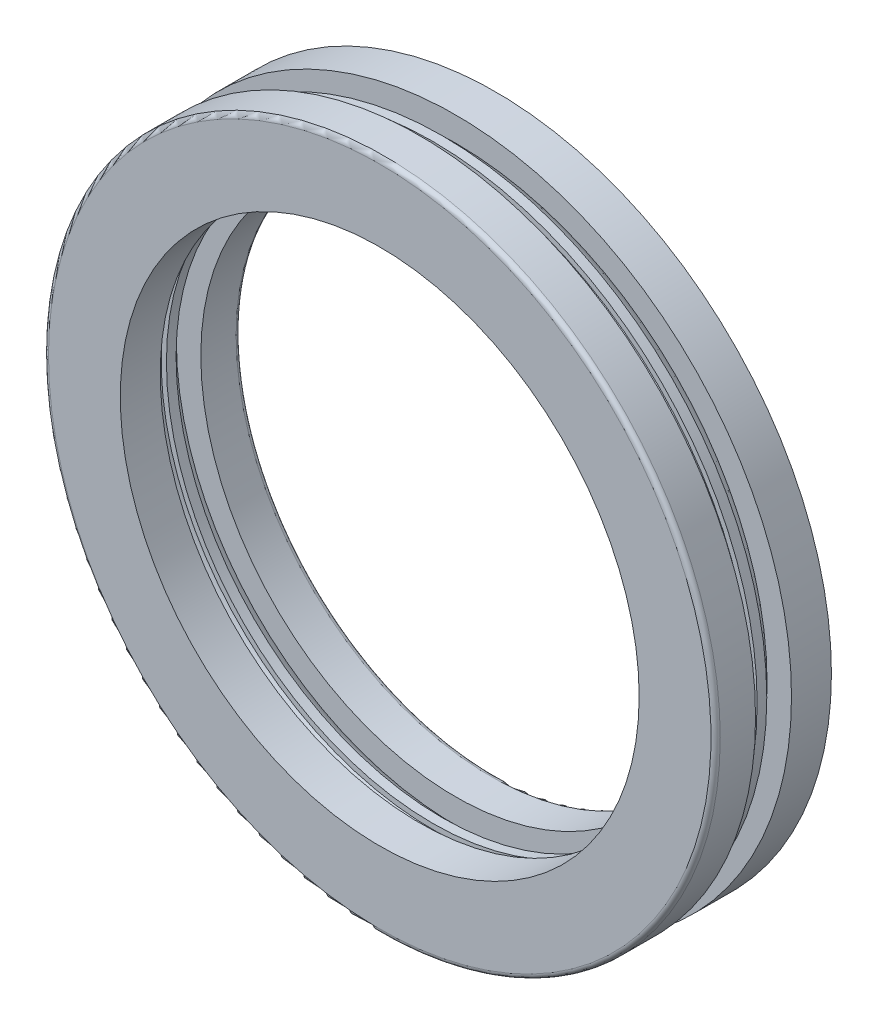
ISO-10303-21;
HEADER;
FILE_DESCRIPTION(('STEP AP214'),'2;1');
FILE_NAME('part.step','',(''),(''),'','','');
FILE_SCHEMA(('AUTOMOTIVE_DESIGN { 1 0 10303 214 1 1 1 1 }'));
ENDSEC;
DATA;
#1=APPLICATION_CONTEXT('core data for automotive mechanical design processes');
#2=APPLICATION_PROTOCOL_DEFINITION('international standard','automotive_design',2000,#1);
#3=PRODUCT_CONTEXT('',#1,'mechanical');
#4=PRODUCT('Part','Part','',(#3));
#5=PRODUCT_RELATED_PRODUCT_CATEGORY('part','',(#4));
#6=PRODUCT_DEFINITION_FORMATION('','',#4);
#7=PRODUCT_DEFINITION_CONTEXT('part definition',#1,'design');
#8=PRODUCT_DEFINITION('design','',#6,#7);
#9=PRODUCT_DEFINITION_SHAPE('','',#8);
#10=(LENGTH_UNIT() NAMED_UNIT(*) SI_UNIT(.MILLI.,.METRE.));
#11=(NAMED_UNIT(*) PLANE_ANGLE_UNIT() SI_UNIT($,.RADIAN.));
#12=(NAMED_UNIT(*) SI_UNIT($,.STERADIAN.) SOLID_ANGLE_UNIT());
#13=UNCERTAINTY_MEASURE_WITH_UNIT(LENGTH_MEASURE(1.E-05),#10,'distance_accuracy_value','');
#14=(GEOMETRIC_REPRESENTATION_CONTEXT(3) GLOBAL_UNCERTAINTY_ASSIGNED_CONTEXT((#13)) GLOBAL_UNIT_ASSIGNED_CONTEXT((#10,
#11,#12)) REPRESENTATION_CONTEXT('',''));
#15=CARTESIAN_POINT('',(0.,0.,0.));
#16=DIRECTION('',(0.,0.,1.));
#17=DIRECTION('',(1.,0.,0.));
#18=AXIS2_PLACEMENT_3D('',#15,#16,#17);
#19=CARTESIAN_POINT('',(0.,72.5,-3.87931034482759));
#20=DIRECTION('',(0.,0.,-1.));
#21=DIRECTION('',(-1.,0.,0.));
#22=AXIS2_PLACEMENT_3D('',#19,#20,#21);
#23=PLANE('',#22);
#24=CARTESIAN_POINT('',(0.,0.,-3.87931034482759));
#25=DIRECTION('',(0.,0.,1.));
#26=DIRECTION('',(1.,0.,0.));
#27=AXIS2_PLACEMENT_3D('',#24,#25,#26);
#28=CIRCLE('',#27,72.5);
#29=CARTESIAN_POINT('',(72.5,0.,-3.87931034482759));
#30=VERTEX_POINT('',#29);
#31=EDGE_CURVE('E83',#30,#30,#28,.T.);
#32=ORIENTED_EDGE('',*,*,#31,.T.);
#33=EDGE_LOOP('',(#32));
#34=FACE_BOUND('',#33,.T.);
#35=CARTESIAN_POINT('',(0.,0.,-3.87931034482759));
#36=DIRECTION('',(0.,0.,-1.));
#37=DIRECTION('',(-1.,0.,0.));
#38=AXIS2_PLACEMENT_3D('',#35,#36,#37);
#39=CIRCLE('',#38,67.2252967297232);
#40=CARTESIAN_POINT('',(-67.2252967297232,0.,-3.87931034482759));
#41=VERTEX_POINT('',#40);
#42=EDGE_CURVE('E10',#41,#41,#39,.F.);
#43=ORIENTED_EDGE('',*,*,#42,.F.);
#44=EDGE_LOOP('',(#43));
#45=FACE_BOUND('',#44,.T.);
#46=ADVANCED_FACE('F35',(#34,#45),#23,.F.);
#47=CARTESIAN_POINT('',(0.,60.2897080046681,-3.87931034482759));
#48=DIRECTION('',(0.,0.,-1.));
#49=DIRECTION('',(-1.,0.,0.));
#50=AXIS2_PLACEMENT_3D('',#47,#48,#49);
#51=PLANE('',#50);
#52=CARTESIAN_POINT('',(0.,0.,-3.87931034482759));
#53=DIRECTION('',(0.,0.,1.));
#54=DIRECTION('',(1.,0.,0.));
#55=AXIS2_PLACEMENT_3D('',#52,#53,#54);
#56=CIRCLE('',#55,55.);
#57=CARTESIAN_POINT('',(55.,0.,-3.87931034482759));
#58=VERTEX_POINT('',#57);
#59=EDGE_CURVE('E90',#58,#58,#56,.T.);
#60=ORIENTED_EDGE('',*,*,#59,.F.);
#61=EDGE_LOOP('',(#60));
#62=FACE_BOUND('',#61,.T.);
#63=CARTESIAN_POINT('',(0.,0.,-3.87931034482759));
#64=DIRECTION('',(0.,0.,1.));
#65=DIRECTION('',(1.,0.,0.));
#66=AXIS2_PLACEMENT_3D('',#63,#64,#65);
#67=CIRCLE('',#66,60.2747032702768);
#68=CARTESIAN_POINT('',(60.2747032702768,0.,-3.87931034482759));
#69=VERTEX_POINT('',#68);
#70=EDGE_CURVE('E44',#69,#69,#67,.F.);
#71=ORIENTED_EDGE('',*,*,#70,.F.);
#72=EDGE_LOOP('',(#71));
#73=FACE_BOUND('',#72,.T.);
#74=ADVANCED_FACE('F163',(#62,#73),#51,.F.);
#75=CARTESIAN_POINT('',(0.,0.,18.9590379297716));
#76=DIRECTION('',(0.,0.,1.));
#77=DIRECTION('',(1.,0.,0.));
#78=AXIS2_PLACEMENT_3D('',#75,#76,#77);
#79=CYLINDRICAL_SURFACE('',#78,55.);
#80=CARTESIAN_POINT('',(0.,0.,-11.5));
#81=DIRECTION('',(0.,0.,1.));
#82=DIRECTION('',(1.,0.,0.));
#83=AXIS2_PLACEMENT_3D('',#80,#81,#82);
#84=CIRCLE('',#83,55.);
#85=CARTESIAN_POINT('',(55.,0.,-11.5));
#86=VERTEX_POINT('',#85);
#87=EDGE_CURVE('E39',#86,#86,#84,.F.);
#88=ORIENTED_EDGE('',*,*,#87,.T.);
#89=EDGE_LOOP('',(#88));
#90=FACE_BOUND('',#89,.T.);
#91=ORIENTED_EDGE('',*,*,#59,.T.);
#92=EDGE_LOOP('',(#91));
#93=FACE_BOUND('',#92,.T.);
#94=ADVANCED_FACE('F169',(#90,#93),#79,.F.);
#95=CARTESIAN_POINT('',(0.,72.5,-12.5));
#96=DIRECTION('',(0.,0.,1.));
#97=DIRECTION('',(1.,0.,0.));
#98=AXIS2_PLACEMENT_3D('',#95,#96,#97);
#99=PLANE('',#98);
#100=CARTESIAN_POINT('',(0.,0.,-12.5));
#101=DIRECTION('',(0.,0.,1.));
#102=DIRECTION('',(1.,0.,0.));
#103=AXIS2_PLACEMENT_3D('',#100,#101,#102);
#104=CIRCLE('',#103,56.);
#105=CARTESIAN_POINT('',(56.,0.,-12.5));
#106=VERTEX_POINT('',#105);
#107=EDGE_CURVE('E101',#106,#106,#104,.T.);
#108=ORIENTED_EDGE('',*,*,#107,.T.);
#109=EDGE_LOOP('',(#108));
#110=FACE_BOUND('',#109,.T.);
#111=CARTESIAN_POINT('',(0.,0.,-12.5));
#112=DIRECTION('',(0.,0.,1.));
#113=DIRECTION('',(1.,0.,0.));
#114=AXIS2_PLACEMENT_3D('',#111,#112,#113);
#115=CIRCLE('',#114,72.5);
#116=CARTESIAN_POINT('',(72.5,0.,-12.5));
#117=VERTEX_POINT('',#116);
#118=EDGE_CURVE('E87',#117,#117,#115,.T.);
#119=ORIENTED_EDGE('',*,*,#118,.F.);
#120=EDGE_LOOP('',(#119));
#121=FACE_BOUND('',#120,.T.);
#122=ADVANCED_FACE('F210',(#110,#121),#99,.F.);
#123=CARTESIAN_POINT('',(0.,0.,18.9590379297716));
#124=DIRECTION('',(0.,0.,1.));
#125=DIRECTION('',(1.,0.,0.));
#126=AXIS2_PLACEMENT_3D('',#123,#124,#125);
#127=CYLINDRICAL_SURFACE('',#126,72.5);
#128=ORIENTED_EDGE('',*,*,#31,.F.);
#129=EDGE_LOOP('',(#128));
#130=FACE_BOUND('',#129,.T.);
#131=ORIENTED_EDGE('',*,*,#118,.T.);
#132=EDGE_LOOP('',(#131));
#133=FACE_BOUND('',#132,.T.);
#134=ADVANCED_FACE('F207',(#130,#133),#127,.T.);
#135=CARTESIAN_POINT('',(0.,0.,-11.5));
#136=DIRECTION('',(0.,0.,1.));
#137=DIRECTION('',(1.,0.,0.));
#138=AXIS2_PLACEMENT_3D('',#135,#136,#137);
#139=TOROIDAL_SURFACE('',#138,56.,1.);
#140=ORIENTED_EDGE('',*,*,#87,.F.);
#141=EDGE_LOOP('',(#140));
#142=FACE_BOUND('',#141,.T.);
#143=ORIENTED_EDGE('',*,*,#107,.F.);
#144=EDGE_LOOP('',(#143));
#145=FACE_BOUND('',#144,.T.);
#146=ADVANCED_FACE('F37',(#142,#145),#139,.T.);
#147=CARTESIAN_POINT('',(0.,0.,0.));
#148=DIRECTION('',(0.,0.,1.));
#149=DIRECTION('',(1.,0.,0.));
#150=AXIS2_PLACEMENT_3D('',#147,#148,#149);
#151=TOROIDAL_SURFACE('',#150,63.75,5.20833333333333);
#152=CARTESIAN_POINT('',(0.,0.,-1.04166666666667));
#153=DIRECTION('',(0.,0.,-1.));
#154=DIRECTION('',(-1.,0.,0.));
#155=AXIS2_PLACEMENT_3D('',#152,#153,#154);
#156=CIRCLE('',#155,58.6468963692017);
#157=CARTESIAN_POINT('',(-58.6468963692017,0.,-1.04166666666667));
#158=VERTEX_POINT('',#157);
#159=EDGE_CURVE('E129',#158,#158,#156,.F.);
#160=ORIENTED_EDGE('',*,*,#159,.T.);
#161=EDGE_LOOP('',(#160));
#162=FACE_BOUND('',#161,.T.);
#163=ORIENTED_EDGE('',*,*,#70,.T.);
#164=EDGE_LOOP('',(#163));
#165=FACE_BOUND('',#164,.T.);
#166=ADVANCED_FACE('F221',(#162,#165),#151,.T.);
#167=ORIENTED_EDGE('',*,*,#42,.T.);
#168=EDGE_LOOP('',(#167));
#169=FACE_BOUND('',#168,.T.);
#170=CARTESIAN_POINT('',(0.,0.,-1.04166666666667));
#171=DIRECTION('',(0.,0.,1.));
#172=DIRECTION('',(1.,0.,0.));
#173=AXIS2_PLACEMENT_3D('',#170,#171,#172);
#174=CIRCLE('',#173,68.8531036307983);
#175=CARTESIAN_POINT('',(68.8531036307983,0.,-1.04166666666667));
#176=VERTEX_POINT('',#175);
#177=EDGE_CURVE('E51',#176,#176,#174,.F.);
#178=ORIENTED_EDGE('',*,*,#177,.T.);
#179=EDGE_LOOP('',(#178));
#180=FACE_BOUND('',#179,.T.);
#181=ADVANCED_FACE('F138',(#169,#180),#151,.T.);
#182=CARTESIAN_POINT('',(0.,70.,-1.04166666666667));
#183=DIRECTION('',(0.,0.,1.));
#184=DIRECTION('',(1.,0.,0.));
#185=AXIS2_PLACEMENT_3D('',#182,#183,#184);
#186=PLANE('',#185);
#187=CARTESIAN_POINT('',(0.,0.,-1.04166666666667));
#188=DIRECTION('',(0.,0.,1.));
#189=DIRECTION('',(1.,0.,0.));
#190=AXIS2_PLACEMENT_3D('',#187,#188,#189);
#191=CIRCLE('',#190,57.5);
#192=CARTESIAN_POINT('',(57.5,0.,-1.04166666666667));
#193=VERTEX_POINT('',#192);
#194=EDGE_CURVE('E67',#193,#193,#191,.T.);
#195=ORIENTED_EDGE('',*,*,#194,.T.);
#196=EDGE_LOOP('',(#195));
#197=FACE_BOUND('',#196,.T.);
#198=ORIENTED_EDGE('',*,*,#159,.F.);
#199=EDGE_LOOP('',(#198));
#200=FACE_BOUND('',#199,.T.);
#201=ADVANCED_FACE('F146',(#197,#200),#186,.F.);
#202=CARTESIAN_POINT('',(0.,0.,23.0770303775765));
#203=DIRECTION('',(0.,0.,1.));
#204=DIRECTION('',(1.,0.,0.));
#205=AXIS2_PLACEMENT_3D('',#202,#203,#204);
#206=CYLINDRICAL_SURFACE('',#205,57.5);
#207=ORIENTED_EDGE('',*,*,#194,.F.);
#208=EDGE_LOOP('',(#207));
#209=FACE_BOUND('',#208,.T.);
#210=CARTESIAN_POINT('',(0.,0.,1.04166666666667));
#211=DIRECTION('',(0.,0.,1.));
#212=DIRECTION('',(1.,0.,0.));
#213=AXIS2_PLACEMENT_3D('',#210,#211,#212);
#214=CIRCLE('',#213,57.5);
#215=CARTESIAN_POINT('',(57.5,0.,1.04166666666667));
#216=VERTEX_POINT('',#215);
#217=EDGE_CURVE('E63',#216,#216,#214,.T.);
#218=ORIENTED_EDGE('',*,*,#217,.T.);
#219=EDGE_LOOP('',(#218));
#220=FACE_BOUND('',#219,.T.);
#221=ADVANCED_FACE('F154',(#209,#220),#206,.F.);
#222=CARTESIAN_POINT('',(0.,70.,1.04166666666667));
#223=DIRECTION('',(0.,0.,-1.));
#224=DIRECTION('',(-1.,0.,0.));
#225=AXIS2_PLACEMENT_3D('',#222,#223,#224);
#226=PLANE('',#225);
#227=ORIENTED_EDGE('',*,*,#217,.F.);
#228=EDGE_LOOP('',(#227));
#229=FACE_BOUND('',#228,.T.);
#230=CARTESIAN_POINT('',(0.,0.,1.04166666666667));
#231=DIRECTION('',(0.,0.,1.));
#232=DIRECTION('',(1.,0.,0.));
#233=AXIS2_PLACEMENT_3D('',#230,#231,#232);
#234=CIRCLE('',#233,58.6468963692017);
#235=CARTESIAN_POINT('',(58.6468963692017,0.,1.04166666666667));
#236=VERTEX_POINT('',#235);
#237=EDGE_CURVE('E119',#236,#236,#234,.F.);
#238=ORIENTED_EDGE('',*,*,#237,.F.);
#239=EDGE_LOOP('',(#238));
#240=FACE_BOUND('',#239,.T.);
#241=ADVANCED_FACE('F143',(#229,#240),#226,.F.);
#242=CARTESIAN_POINT('',(0.,0.,-1.04166666666667));
#243=DIRECTION('',(0.,0.,1.));
#244=DIRECTION('',(1.,0.,0.));
#245=AXIS2_PLACEMENT_3D('',#242,#243,#244);
#246=CIRCLE('',#245,70.);
#247=CARTESIAN_POINT('',(70.,0.,-1.04166666666667));
#248=VERTEX_POINT('',#247);
#249=EDGE_CURVE('E55',#248,#248,#246,.T.);
#250=ORIENTED_EDGE('',*,*,#249,.F.);
#251=EDGE_LOOP('',(#250));
#252=FACE_BOUND('',#251,.T.);
#253=ORIENTED_EDGE('',*,*,#177,.F.);
#254=EDGE_LOOP('',(#253));
#255=FACE_BOUND('',#254,.T.);
#256=ADVANCED_FACE('F140',(#252,#255),#186,.F.);
#257=CARTESIAN_POINT('',(0.,0.,23.0770303775765));
#258=DIRECTION('',(0.,0.,1.));
#259=DIRECTION('',(1.,0.,0.));
#260=AXIS2_PLACEMENT_3D('',#257,#258,#259);
#261=CYLINDRICAL_SURFACE('',#260,70.);
#262=CARTESIAN_POINT('',(0.,0.,1.04166666666667));
#263=DIRECTION('',(0.,0.,1.));
#264=DIRECTION('',(1.,0.,0.));
#265=AXIS2_PLACEMENT_3D('',#262,#263,#264);
#266=CIRCLE('',#265,70.);
#267=CARTESIAN_POINT('',(70.,0.,1.04166666666667));
#268=VERTEX_POINT('',#267);
#269=EDGE_CURVE('E59',#268,#268,#266,.T.);
#270=ORIENTED_EDGE('',*,*,#269,.F.);
#271=EDGE_LOOP('',(#270));
#272=FACE_BOUND('',#271,.T.);
#273=ORIENTED_EDGE('',*,*,#249,.T.);
#274=EDGE_LOOP('',(#273));
#275=FACE_BOUND('',#274,.T.);
#276=ADVANCED_FACE('F142',(#272,#275),#261,.T.);
#277=ORIENTED_EDGE('',*,*,#269,.T.);
#278=EDGE_LOOP('',(#277));
#279=FACE_BOUND('',#278,.T.);
#280=CARTESIAN_POINT('',(0.,0.,1.04166666666667));
#281=DIRECTION('',(0.,0.,-1.));
#282=DIRECTION('',(-1.,0.,0.));
#283=AXIS2_PLACEMENT_3D('',#280,#281,#282);
#284=CIRCLE('',#283,68.8531036307983);
#285=CARTESIAN_POINT('',(-68.8531036307983,0.,1.04166666666667));
#286=VERTEX_POINT('',#285);
#287=EDGE_CURVE('E124',#286,#286,#284,.F.);
#288=ORIENTED_EDGE('',*,*,#287,.F.);
#289=EDGE_LOOP('',(#288));
#290=FACE_BOUND('',#289,.T.);
#291=ADVANCED_FACE('F151',(#279,#290),#226,.F.);
#292=CARTESIAN_POINT('',(0.,0.,3.87931034482758));
#293=DIRECTION('',(0.,0.,-1.));
#294=DIRECTION('',(-1.,0.,0.));
#295=AXIS2_PLACEMENT_3D('',#292,#293,#294);
#296=CIRCLE('',#295,60.2747032702768);
#297=CARTESIAN_POINT('',(-60.2747032702768,0.,3.87931034482758));
#298=VERTEX_POINT('',#297);
#299=EDGE_CURVE('E108',#298,#298,#296,.F.);
#300=ORIENTED_EDGE('',*,*,#299,.T.);
#301=EDGE_LOOP('',(#300));
#302=FACE_BOUND('',#301,.T.);
#303=ORIENTED_EDGE('',*,*,#237,.T.);
#304=EDGE_LOOP('',(#303));
#305=FACE_BOUND('',#304,.T.);
#306=ADVANCED_FACE('F195',(#302,#305),#151,.T.);
#307=CARTESIAN_POINT('',(0.,72.5,12.5));
#308=DIRECTION('',(0.,0.,-1.));
#309=DIRECTION('',(-1.,0.,0.));
#310=AXIS2_PLACEMENT_3D('',#307,#308,#309);
#311=PLANE('',#310);
#312=CARTESIAN_POINT('',(0.,0.,12.5));
#313=DIRECTION('',(0.,0.,-1.));
#314=DIRECTION('',(-1.,0.,0.));
#315=AXIS2_PLACEMENT_3D('',#312,#313,#314);
#316=CIRCLE('',#315,71.5);
#317=CARTESIAN_POINT('',(-71.5,0.,12.5));
#318=VERTEX_POINT('',#317);
#319=EDGE_CURVE('E94',#318,#318,#316,.F.);
#320=ORIENTED_EDGE('',*,*,#319,.T.);
#321=EDGE_LOOP('',(#320));
#322=FACE_BOUND('',#321,.T.);
#323=CARTESIAN_POINT('',(0.,0.,12.5));
#324=DIRECTION('',(0.,0.,1.));
#325=DIRECTION('',(1.,0.,0.));
#326=AXIS2_PLACEMENT_3D('',#323,#324,#325);
#327=CIRCLE('',#326,56.);
#328=CARTESIAN_POINT('',(56.,0.,12.5));
#329=VERTEX_POINT('',#328);
#330=EDGE_CURVE('E79',#329,#329,#327,.T.);
#331=ORIENTED_EDGE('',*,*,#330,.F.);
#332=EDGE_LOOP('',(#331));
#333=FACE_BOUND('',#332,.T.);
#334=ADVANCED_FACE('F192',(#322,#333),#311,.F.);
#335=CARTESIAN_POINT('',(0.,0.,27.1643435870104));
#336=DIRECTION('',(0.,0.,1.));
#337=DIRECTION('',(1.,0.,0.));
#338=AXIS2_PLACEMENT_3D('',#335,#336,#337);
#339=CYLINDRICAL_SURFACE('',#338,56.);
#340=CARTESIAN_POINT('',(0.,0.,3.87931034482758));
#341=DIRECTION('',(0.,0.,1.));
#342=DIRECTION('',(1.,0.,0.));
#343=AXIS2_PLACEMENT_3D('',#340,#341,#342);
#344=CIRCLE('',#343,56.);
#345=CARTESIAN_POINT('',(56.,0.,3.87931034482758));
#346=VERTEX_POINT('',#345);
#347=EDGE_CURVE('E75',#346,#346,#344,.T.);
#348=ORIENTED_EDGE('',*,*,#347,.F.);
#349=EDGE_LOOP('',(#348));
#350=FACE_BOUND('',#349,.T.);
#351=ORIENTED_EDGE('',*,*,#330,.T.);
#352=EDGE_LOOP('',(#351));
#353=FACE_BOUND('',#352,.T.);
#354=ADVANCED_FACE('F185',(#350,#353),#339,.F.);
#355=CARTESIAN_POINT('',(0.,60.2897080046681,3.87931034482758));
#356=DIRECTION('',(0.,0.,1.));
#357=DIRECTION('',(1.,0.,0.));
#358=AXIS2_PLACEMENT_3D('',#355,#356,#357);
#359=PLANE('',#358);
#360=ORIENTED_EDGE('',*,*,#347,.T.);
#361=EDGE_LOOP('',(#360));
#362=FACE_BOUND('',#361,.T.);
#363=ORIENTED_EDGE('',*,*,#299,.F.);
#364=EDGE_LOOP('',(#363));
#365=FACE_BOUND('',#364,.T.);
#366=ADVANCED_FACE('F177',(#362,#365),#359,.F.);
#367=CARTESIAN_POINT('',(0.,0.,11.5));
#368=DIRECTION('',(0.,0.,-1.));
#369=DIRECTION('',(-1.,0.,0.));
#370=AXIS2_PLACEMENT_3D('',#367,#368,#369);
#371=TOROIDAL_SURFACE('',#370,71.5,1.);
#372=CARTESIAN_POINT('',(0.,0.,11.5));
#373=DIRECTION('',(0.,0.,-1.));
#374=DIRECTION('',(-1.,0.,0.));
#375=AXIS2_PLACEMENT_3D('',#372,#373,#374);
#376=CIRCLE('',#375,72.5);
#377=CARTESIAN_POINT('',(-72.5,0.,11.5));
#378=VERTEX_POINT('',#377);
#379=EDGE_CURVE('E98',#378,#378,#376,.T.);
#380=ORIENTED_EDGE('',*,*,#379,.F.);
#381=EDGE_LOOP('',(#380));
#382=FACE_BOUND('',#381,.T.);
#383=ORIENTED_EDGE('',*,*,#319,.F.);
#384=EDGE_LOOP('',(#383));
#385=FACE_BOUND('',#384,.T.);
#386=ADVANCED_FACE('F174',(#382,#385),#371,.T.);
#387=CARTESIAN_POINT('',(0.,0.,27.1643435870104));
#388=DIRECTION('',(0.,0.,1.));
#389=DIRECTION('',(1.,0.,0.));
#390=AXIS2_PLACEMENT_3D('',#387,#388,#389);
#391=CYLINDRICAL_SURFACE('',#390,72.5);
#392=ORIENTED_EDGE('',*,*,#379,.T.);
#393=EDGE_LOOP('',(#392));
#394=FACE_BOUND('',#393,.T.);
#395=CARTESIAN_POINT('',(0.,0.,3.87931034482758));
#396=DIRECTION('',(0.,0.,1.));
#397=DIRECTION('',(1.,0.,0.));
#398=AXIS2_PLACEMENT_3D('',#395,#396,#397);
#399=CIRCLE('',#398,72.5);
#400=CARTESIAN_POINT('',(72.5,0.,3.87931034482758));
#401=VERTEX_POINT('',#400);
#402=EDGE_CURVE('E71',#401,#401,#399,.T.);
#403=ORIENTED_EDGE('',*,*,#402,.T.);
#404=EDGE_LOOP('',(#403));
#405=FACE_BOUND('',#404,.T.);
#406=ADVANCED_FACE('F176',(#394,#405),#391,.T.);
#407=CARTESIAN_POINT('',(0.,72.5,3.87931034482758));
#408=DIRECTION('',(0.,0.,1.));
#409=DIRECTION('',(1.,0.,0.));
#410=AXIS2_PLACEMENT_3D('',#407,#408,#409);
#411=PLANE('',#410);
#412=ORIENTED_EDGE('',*,*,#402,.F.);
#413=EDGE_LOOP('',(#412));
#414=FACE_BOUND('',#413,.T.);
#415=CARTESIAN_POINT('',(0.,0.,3.87931034482758));
#416=DIRECTION('',(0.,0.,1.));
#417=DIRECTION('',(1.,0.,0.));
#418=AXIS2_PLACEMENT_3D('',#415,#416,#417);
#419=CIRCLE('',#418,67.2252967297232);
#420=CARTESIAN_POINT('',(67.2252967297232,0.,3.87931034482758));
#421=VERTEX_POINT('',#420);
#422=EDGE_CURVE('E113',#421,#421,#419,.F.);
#423=ORIENTED_EDGE('',*,*,#422,.F.);
#424=EDGE_LOOP('',(#423));
#425=FACE_BOUND('',#424,.T.);
#426=ADVANCED_FACE('F183',(#414,#425),#411,.F.);
#427=ORIENTED_EDGE('',*,*,#287,.T.);
#428=EDGE_LOOP('',(#427));
#429=FACE_BOUND('',#428,.T.);
#430=ORIENTED_EDGE('',*,*,#422,.T.);
#431=EDGE_LOOP('',(#430));
#432=FACE_BOUND('',#431,.T.);
#433=ADVANCED_FACE('F224',(#429,#432),#151,.T.);
#434=CLOSED_SHELL('',(#46,#74,#94,#122,#134,#146,#166,#181,#201,#221,#241,#256,#276,#291,#306,
#334,#354,#366,#386,#406,#426,#433));
#435=MANIFOLD_SOLID_BREP('B2',#434);
#436=ADVANCED_BREP_SHAPE_REPRESENTATION('',(#18,#435),#14);
#437=SHAPE_DEFINITION_REPRESENTATION(#9,#436);
ENDSEC;
END-ISO-10303-21;
